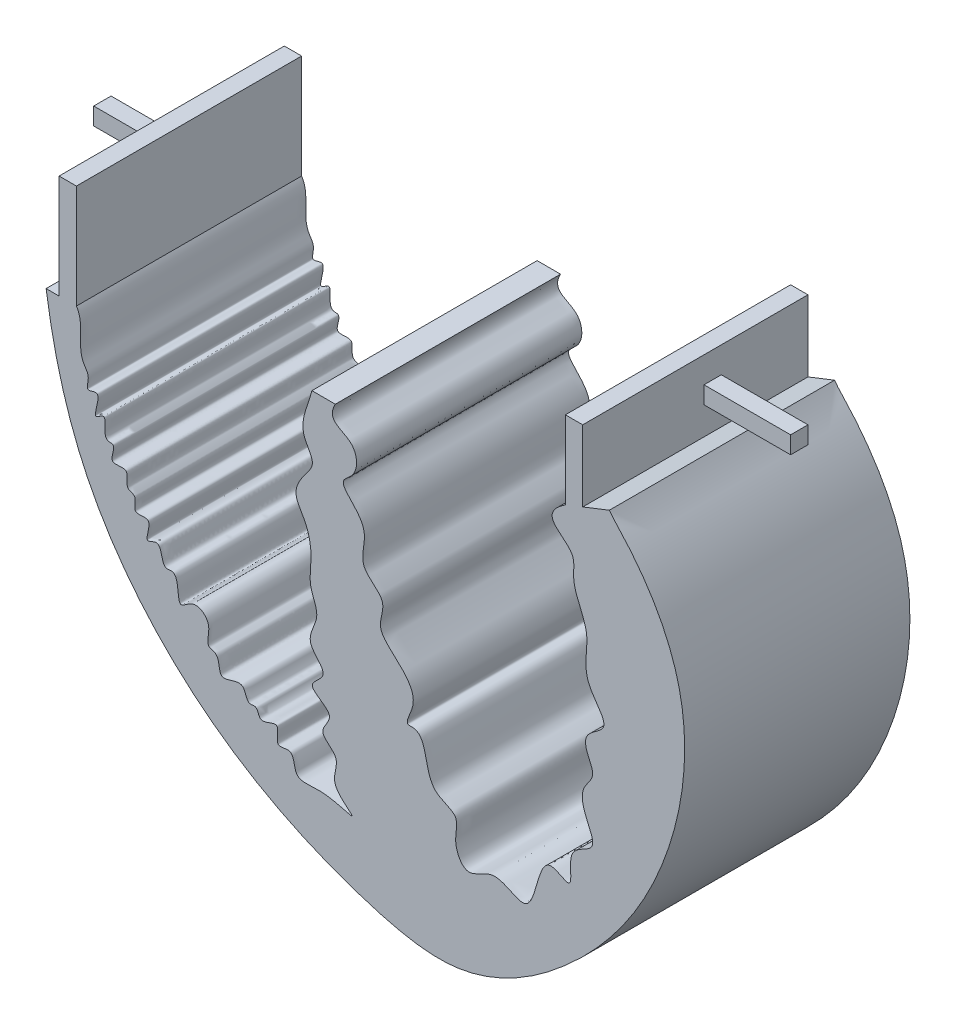
ISO-10303-21;
HEADER;
FILE_DESCRIPTION(('STEP AP214'),'2;1');
FILE_NAME('part.step','',(''),(''),'','','');
FILE_SCHEMA(('AUTOMOTIVE_DESIGN { 1 0 10303 214 1 1 1 1 }'));
ENDSEC;
DATA;
#1=APPLICATION_CONTEXT('core data for automotive mechanical design processes');
#2=APPLICATION_PROTOCOL_DEFINITION('international standard','automotive_design',2000,#1);
#3=PRODUCT_CONTEXT('',#1,'mechanical');
#4=PRODUCT('Part','Part','',(#3));
#5=PRODUCT_RELATED_PRODUCT_CATEGORY('part','',(#4));
#6=PRODUCT_DEFINITION_FORMATION('','',#4);
#7=PRODUCT_DEFINITION_CONTEXT('part definition',#1,'design');
#8=PRODUCT_DEFINITION('design','',#6,#7);
#9=PRODUCT_DEFINITION_SHAPE('','',#8);
#10=(LENGTH_UNIT() NAMED_UNIT(*) SI_UNIT(.MILLI.,.METRE.));
#11=(NAMED_UNIT(*) PLANE_ANGLE_UNIT() SI_UNIT($,.RADIAN.));
#12=(NAMED_UNIT(*) SI_UNIT($,.STERADIAN.) SOLID_ANGLE_UNIT());
#13=UNCERTAINTY_MEASURE_WITH_UNIT(LENGTH_MEASURE(1.E-05),#10,'distance_accuracy_value','');
#14=(GEOMETRIC_REPRESENTATION_CONTEXT(3) GLOBAL_UNCERTAINTY_ASSIGNED_CONTEXT((#13)) GLOBAL_UNIT_ASSIGNED_CONTEXT((#10,
#11,#12)) REPRESENTATION_CONTEXT('',''));
#15=CARTESIAN_POINT('',(0.,0.,0.));
#16=DIRECTION('',(0.,0.,1.));
#17=DIRECTION('',(1.,0.,0.));
#18=AXIS2_PLACEMENT_3D('',#15,#16,#17);
#19=CARTESIAN_POINT('',(234.782900174087,315.001155653343,33.02));
#20=DIRECTION('',(-1.,0.,0.));
#21=DIRECTION('',(0.,-1.,0.));
#22=AXIS2_PLACEMENT_3D('',#19,#20,#21);
#23=PLANE('',#22);
#24=DIRECTION('',(0.,1.,0.));
#25=VECTOR('',#24,1.);
#26=CARTESIAN_POINT('',(234.782900174087,315.001155653343,0.));
#27=LINE('',#26,#25);
#28=CARTESIAN_POINT('',(234.782900174087,315.001155653343,0.));
#29=VERTEX_POINT('',#28);
#30=CARTESIAN_POINT('',(234.782900174087,325.43096637939,0.));
#31=VERTEX_POINT('',#30);
#32=EDGE_CURVE('E648',#29,#31,#27,.T.);
#33=ORIENTED_EDGE('',*,*,#32,.T.);
#34=DIRECTION('',(0.,0.,-1.));
#35=VECTOR('',#34,1.);
#36=CARTESIAN_POINT('',(234.782900174087,325.43096637939,33.02));
#37=LINE('',#36,#35);
#38=CARTESIAN_POINT('',(234.782900174087,325.43096637939,33.02));
#39=VERTEX_POINT('',#38);
#40=EDGE_CURVE('E655',#39,#31,#37,.T.);
#41=ORIENTED_EDGE('',*,*,#40,.F.);
#42=DIRECTION('',(0.,1.,0.));
#43=VECTOR('',#42,1.);
#44=CARTESIAN_POINT('',(234.782900174087,315.001155653343,33.02));
#45=LINE('',#44,#43);
#46=CARTESIAN_POINT('',(234.782900174087,315.001155653343,33.02));
#47=VERTEX_POINT('',#46);
#48=EDGE_CURVE('E653',#47,#39,#45,.T.);
#49=ORIENTED_EDGE('',*,*,#48,.F.);
#50=DIRECTION('',(0.,0.,-1.));
#51=VECTOR('',#50,1.);
#52=CARTESIAN_POINT('',(234.782900174087,315.001155653343,33.02));
#53=LINE('',#52,#51);
#54=EDGE_CURVE('E641',#47,#29,#53,.T.);
#55=ORIENTED_EDGE('',*,*,#54,.T.);
#56=EDGE_LOOP('',(#33,#41,#49,#55));
#57=FACE_BOUND('',#56,.T.);
#58=DIRECTION('',(0.,-1.,0.));
#59=VECTOR('',#58,1.);
#60=CARTESIAN_POINT('',(234.782900174087,321.620966379391,15.24));
#61=LINE('',#60,#59);
#62=CARTESIAN_POINT('',(234.782900174087,321.620966379391,15.24));
#63=VERTEX_POINT('',#62);
#64=CARTESIAN_POINT('',(234.782900174087,319.080966379391,15.24));
#65=VERTEX_POINT('',#64);
#66=EDGE_CURVE('E209',#63,#65,#61,.T.);
#67=ORIENTED_EDGE('',*,*,#66,.F.);
#68=DIRECTION('',(0.,0.,1.));
#69=VECTOR('',#68,1.);
#70=CARTESIAN_POINT('',(234.782900174087,321.620966379391,15.24));
#71=LINE('',#70,#69);
#72=CARTESIAN_POINT('',(234.782900174087,321.620966379391,12.7));
#73=VERTEX_POINT('',#72);
#74=EDGE_CURVE('E206',#73,#63,#71,.T.);
#75=ORIENTED_EDGE('',*,*,#74,.F.);
#76=DIRECTION('',(0.,1.,0.));
#77=VECTOR('',#76,1.);
#78=CARTESIAN_POINT('',(234.782900174087,321.620966379391,12.7));
#79=LINE('',#78,#77);
#80=CARTESIAN_POINT('',(234.782900174087,319.080966379391,12.7));
#81=VERTEX_POINT('',#80);
#82=EDGE_CURVE('E70',#81,#73,#79,.T.);
#83=ORIENTED_EDGE('',*,*,#82,.F.);
#84=DIRECTION('',(0.,0.,-1.));
#85=VECTOR('',#84,1.);
#86=CARTESIAN_POINT('',(234.782900174087,319.080966379391,15.24));
#87=LINE('',#86,#85);
#88=EDGE_CURVE('E65',#65,#81,#87,.T.);
#89=ORIENTED_EDGE('',*,*,#88,.F.);
#90=EDGE_LOOP('',(#67,#75,#83,#89));
#91=FACE_BOUND('',#90,.T.);
#92=ADVANCED_FACE('F49',(#57,#91),#23,.F.);
#93=CARTESIAN_POINT('',(158.008998456197,303.390768234558,33.02));
#94=DIRECTION('',(1.,0.,0.));
#95=DIRECTION('',(0.,0.,-1.));
#96=AXIS2_PLACEMENT_3D('',#93,#94,#95);
#97=PLANE('',#96);
#98=DIRECTION('',(0.,-1.,0.));
#99=VECTOR('',#98,1.);
#100=CARTESIAN_POINT('',(158.008998456197,303.390768234558,0.));
#101=LINE('',#100,#99);
#102=CARTESIAN_POINT('',(158.008998456197,318.630768234558,0.));
#103=VERTEX_POINT('',#102);
#104=CARTESIAN_POINT('',(158.008998456197,303.390768234558,0.));
#105=VERTEX_POINT('',#104);
#106=EDGE_CURVE('E262',#103,#105,#101,.T.);
#107=ORIENTED_EDGE('',*,*,#106,.T.);
#108=DIRECTION('',(0.,0.,-1.));
#109=VECTOR('',#108,1.);
#110=CARTESIAN_POINT('',(158.008998456197,303.390768234558,33.02));
#111=LINE('',#110,#109);
#112=CARTESIAN_POINT('',(158.008998456197,303.390768234558,33.02));
#113=VERTEX_POINT('',#112);
#114=EDGE_CURVE('E11',#113,#105,#111,.T.);
#115=ORIENTED_EDGE('',*,*,#114,.F.);
#116=DIRECTION('',(0.,-1.,0.));
#117=VECTOR('',#116,1.);
#118=CARTESIAN_POINT('',(158.008998456197,303.390768234558,33.02));
#119=LINE('',#118,#117);
#120=CARTESIAN_POINT('',(158.008998456197,318.630768234558,33.02));
#121=VERTEX_POINT('',#120);
#122=EDGE_CURVE('E263',#121,#113,#119,.T.);
#123=ORIENTED_EDGE('',*,*,#122,.F.);
#124=DIRECTION('',(0.,0.,-1.));
#125=VECTOR('',#124,1.);
#126=CARTESIAN_POINT('',(158.008998456197,318.630768234558,33.02));
#127=LINE('',#126,#125);
#128=EDGE_CURVE('E694',#121,#103,#127,.T.);
#129=ORIENTED_EDGE('',*,*,#128,.T.);
#130=EDGE_LOOP('',(#107,#115,#123,#129));
#131=FACE_BOUND('',#130,.T.);
#132=DIRECTION('',(0.,-1.,0.));
#133=VECTOR('',#132,1.);
#134=CARTESIAN_POINT('',(158.008998456197,312.280768234558,12.7));
#135=LINE('',#134,#133);
#136=CARTESIAN_POINT('',(158.008998456197,312.280768234558,12.7));
#137=VERTEX_POINT('',#136);
#138=CARTESIAN_POINT('',(158.008998456197,309.740768234558,12.7));
#139=VERTEX_POINT('',#138);
#140=EDGE_CURVE('E211',#137,#139,#135,.T.);
#141=ORIENTED_EDGE('',*,*,#140,.F.);
#142=DIRECTION('',(0.,0.,-1.));
#143=VECTOR('',#142,1.);
#144=CARTESIAN_POINT('',(158.008998456197,312.280768234558,12.7));
#145=LINE('',#144,#143);
#146=CARTESIAN_POINT('',(158.008998456197,312.280768234558,15.24));
#147=VERTEX_POINT('',#146);
#148=EDGE_CURVE('E227',#147,#137,#145,.T.);
#149=ORIENTED_EDGE('',*,*,#148,.F.);
#150=DIRECTION('',(0.,1.,0.));
#151=VECTOR('',#150,1.);
#152=CARTESIAN_POINT('',(158.008998456197,312.280768234558,15.24));
#153=LINE('',#152,#151);
#154=CARTESIAN_POINT('',(158.008998456197,309.740768234558,15.24));
#155=VERTEX_POINT('',#154);
#156=EDGE_CURVE('E240',#155,#147,#153,.T.);
#157=ORIENTED_EDGE('',*,*,#156,.F.);
#158=DIRECTION('',(0.,0.,1.));
#159=VECTOR('',#158,1.);
#160=CARTESIAN_POINT('',(158.008998456197,309.740768234558,12.7));
#161=LINE('',#160,#159);
#162=EDGE_CURVE('E216',#139,#155,#161,.T.);
#163=ORIENTED_EDGE('',*,*,#162,.F.);
#164=EDGE_LOOP('',(#141,#149,#157,#163));
#165=FACE_BOUND('',#164,.T.);
#166=ADVANCED_FACE('F51',(#131,#165),#97,.F.);
#167=CARTESIAN_POINT('',(156.106031245174,303.390768234558,33.02));
#168=DIRECTION('',(0.,-1.,0.));
#169=DIRECTION('',(0.,0.,-1.));
#170=AXIS2_PLACEMENT_3D('',#167,#168,#169);
#171=PLANE('',#170);
#172=DIRECTION('',(-1.,0.,0.));
#173=VECTOR('',#172,1.);
#174=CARTESIAN_POINT('',(156.106031245174,303.390768234558,0.));
#175=LINE('',#174,#173);
#176=CARTESIAN_POINT('',(156.106031245174,303.390768234558,0.));
#177=VERTEX_POINT('',#176);
#178=EDGE_CURVE('E730',#105,#177,#175,.T.);
#179=ORIENTED_EDGE('',*,*,#178,.T.);
#180=DIRECTION('',(0.,0.,-1.));
#181=VECTOR('',#180,1.);
#182=CARTESIAN_POINT('',(156.106031245174,303.390768234558,33.02));
#183=LINE('',#182,#181);
#184=CARTESIAN_POINT('',(156.106031245174,303.390768234558,33.02));
#185=VERTEX_POINT('',#184);
#186=EDGE_CURVE('E58',#185,#177,#183,.T.);
#187=ORIENTED_EDGE('',*,*,#186,.F.);
#188=DIRECTION('',(-1.,0.,0.));
#189=VECTOR('',#188,1.);
#190=CARTESIAN_POINT('',(156.106031245174,303.390768234558,33.02));
#191=LINE('',#190,#189);
#192=EDGE_CURVE('E267',#113,#185,#191,.T.);
#193=ORIENTED_EDGE('',*,*,#192,.F.);
#194=ORIENTED_EDGE('',*,*,#114,.T.);
#195=EDGE_LOOP('',(#179,#187,#193,#194));
#196=FACE_BOUND('',#195,.T.);
#197=ADVANCED_FACE('F287',(#196),#171,.F.);
#198=CARTESIAN_POINT('',(156.106031245174,303.390768234558,33.02));
#199=CARTESIAN_POINT('',(157.104104191123,296.55036160736,33.02));
#200=CARTESIAN_POINT('',(161.019969177918,280.596962499826,33.02));
#201=CARTESIAN_POINT('',(177.796499221937,260.091211672774,33.02));
#202=CARTESIAN_POINT('',(198.125508088676,249.89125202118,33.02));
#203=CARTESIAN_POINT('',(218.238222953923,245.296073749802,33.02));
#204=CARTESIAN_POINT('',(234.550765535229,255.901833712278,33.02));
#205=CARTESIAN_POINT('',(247.937650512557,274.044596413162,33.02));
#206=CARTESIAN_POINT('',(252.142183864828,297.70290722612,33.02));
#207=CARTESIAN_POINT('',(243.608906344327,311.34256770418,33.02));
#208=CARTESIAN_POINT('',(239.060814083883,315.97952400588,33.02));
#209=CARTESIAN_POINT('',(238.685163096089,316.537770424497,33.02));
#210=B_SPLINE_CURVE_WITH_KNOTS('',3,(#198,#199,#200,#201,#202,#203,#204,#205,#206,#207,#208,
#209),.UNSPECIFIED.,.F.,.F.,(4,1,1,1,1,1,1,1,1,4),(0.120046571813157,0.18483385758498,
0.273021776294878,0.359649236978444,0.397816633725217,0.461195161311988,0.526426676141084,
0.612455038105468,0.666069006609974,0.672633998429617),.UNSPECIFIED.);
#211=DIRECTION('',(0.,0.,-1.));
#212=VECTOR('',#211,1.);
#213=SURFACE_OF_LINEAR_EXTRUSION('',#210,#212);
#214=CARTESIAN_POINT('',(156.106031245174,303.390768234558,0.));
#215=CARTESIAN_POINT('',(157.104104191123,296.55036160736,0.));
#216=CARTESIAN_POINT('',(161.019969177918,280.596962499826,0.));
#217=CARTESIAN_POINT('',(177.796499221937,260.091211672774,0.));
#218=CARTESIAN_POINT('',(198.125508088676,249.89125202118,0.));
#219=CARTESIAN_POINT('',(218.238222953923,245.296073749802,0.));
#220=CARTESIAN_POINT('',(234.550765535229,255.901833712278,0.));
#221=CARTESIAN_POINT('',(247.937650512557,274.044596413162,0.));
#222=CARTESIAN_POINT('',(252.142183864828,297.70290722612,0.));
#223=CARTESIAN_POINT('',(243.608906344327,311.34256770418,0.));
#224=CARTESIAN_POINT('',(239.060814083883,315.97952400588,0.));
#225=CARTESIAN_POINT('',(238.685163096089,316.537770424497,0.));
#226=B_SPLINE_CURVE_WITH_KNOTS('',3,(#214,#215,#216,#217,#218,#219,#220,#221,#222,#223,#224,
#225),.UNSPECIFIED.,.F.,.F.,(4,1,1,1,1,1,1,1,1,4),(0.120046571813157,0.18483385758498,
0.273021776294878,0.359649236978444,0.397816633725217,0.461195161311988,0.526426676141084,
0.612455038105468,0.666069006609974,0.672633998429617),.UNSPECIFIED.);
#227=CARTESIAN_POINT('',(238.685163096089,316.537770424497,0.));
#228=VERTEX_POINT('',#227);
#229=EDGE_CURVE('E649',#177,#228,#226,.T.);
#230=ORIENTED_EDGE('',*,*,#229,.T.);
#231=DIRECTION('',(0.,0.,-1.));
#232=VECTOR('',#231,1.);
#233=CARTESIAN_POINT('',(238.685163096089,316.537770424497,33.02));
#234=LINE('',#233,#232);
#235=CARTESIAN_POINT('',(238.685163096089,316.537770424497,33.02));
#236=VERTEX_POINT('',#235);
#237=EDGE_CURVE('E644',#236,#228,#234,.T.);
#238=ORIENTED_EDGE('',*,*,#237,.F.);
#239=EDGE_CURVE('E271',#185,#236,#210,.T.);
#240=ORIENTED_EDGE('',*,*,#239,.F.);
#241=ORIENTED_EDGE('',*,*,#186,.T.);
#242=EDGE_LOOP('',(#230,#238,#240,#241));
#243=FACE_BOUND('',#242,.T.);
#244=ADVANCED_FACE('F283',(#243),#213,.F.);
#245=CARTESIAN_POINT('',(234.782900174087,315.001155653343,33.02));
#246=DIRECTION('',(0.366392347011726,-0.930460449482534,0.));
#247=DIRECTION('',(0.930460449482534,0.366392347011726,0.));
#248=AXIS2_PLACEMENT_3D('',#245,#246,#247);
#249=PLANE('',#248);
#250=DIRECTION('',(-0.930460449482534,-0.366392347011726,0.));
#251=VECTOR('',#250,1.);
#252=CARTESIAN_POINT('',(234.782900174087,315.001155653343,0.));
#253=LINE('',#252,#251);
#254=EDGE_CURVE('E638',#228,#29,#253,.T.);
#255=ORIENTED_EDGE('',*,*,#254,.T.);
#256=ORIENTED_EDGE('',*,*,#54,.F.);
#257=DIRECTION('',(-0.930460449482534,-0.366392347011726,0.));
#258=VECTOR('',#257,1.);
#259=CARTESIAN_POINT('',(234.782900174087,315.001155653343,33.02));
#260=LINE('',#259,#258);
#261=EDGE_CURVE('E277',#236,#47,#260,.T.);
#262=ORIENTED_EDGE('',*,*,#261,.F.);
#263=ORIENTED_EDGE('',*,*,#237,.T.);
#264=EDGE_LOOP('',(#255,#256,#262,#263));
#265=FACE_BOUND('',#264,.T.);
#266=ADVANCED_FACE('F286',(#265),#249,.F.);
#267=CARTESIAN_POINT('',(232.242900174087,325.43096637939,33.02));
#268=DIRECTION('',(0.,-1.,0.));
#269=DIRECTION('',(0.,0.,-1.));
#270=AXIS2_PLACEMENT_3D('',#267,#268,#269);
#271=PLANE('',#270);
#272=DIRECTION('',(-1.,0.,0.));
#273=VECTOR('',#272,1.);
#274=CARTESIAN_POINT('',(232.242900174087,325.43096637939,0.));
#275=LINE('',#274,#273);
#276=CARTESIAN_POINT('',(232.242900174087,325.43096637939,0.));
#277=VERTEX_POINT('',#276);
#278=EDGE_CURVE('E660',#31,#277,#275,.T.);
#279=ORIENTED_EDGE('',*,*,#278,.T.);
#280=DIRECTION('',(0.,0.,-1.));
#281=VECTOR('',#280,1.);
#282=CARTESIAN_POINT('',(232.242900174087,325.43096637939,33.02));
#283=LINE('',#282,#281);
#284=CARTESIAN_POINT('',(232.242900174087,325.43096637939,33.02));
#285=VERTEX_POINT('',#284);
#286=EDGE_CURVE('E719',#285,#277,#283,.T.);
#287=ORIENTED_EDGE('',*,*,#286,.F.);
#288=DIRECTION('',(-1.,0.,0.));
#289=VECTOR('',#288,1.);
#290=CARTESIAN_POINT('',(232.242900174087,325.43096637939,33.02));
#291=LINE('',#290,#289);
#292=EDGE_CURVE('E766',#39,#285,#291,.T.);
#293=ORIENTED_EDGE('',*,*,#292,.F.);
#294=ORIENTED_EDGE('',*,*,#40,.T.);
#295=EDGE_LOOP('',(#279,#287,#293,#294));
#296=FACE_BOUND('',#295,.T.);
#297=ADVANCED_FACE('F301',(#296),#271,.F.);
#298=CARTESIAN_POINT('',(232.242900174087,314.00096637939,33.02));
#299=DIRECTION('',(1.,0.,0.));
#300=DIRECTION('',(0.,1.,0.));
#301=AXIS2_PLACEMENT_3D('',#298,#299,#300);
#302=PLANE('',#301);
#303=DIRECTION('',(0.,-1.,0.));
#304=VECTOR('',#303,1.);
#305=CARTESIAN_POINT('',(232.242900174087,314.00096637939,0.));
#306=LINE('',#305,#304);
#307=CARTESIAN_POINT('',(232.242900174087,314.00096637939,0.));
#308=VERTEX_POINT('',#307);
#309=EDGE_CURVE('E664',#277,#308,#306,.T.);
#310=ORIENTED_EDGE('',*,*,#309,.T.);
#311=DIRECTION('',(0.,0.,-1.));
#312=VECTOR('',#311,1.);
#313=CARTESIAN_POINT('',(232.242900174087,314.00096637939,33.02));
#314=LINE('',#313,#312);
#315=CARTESIAN_POINT('',(232.242900174087,314.00096637939,33.02));
#316=VERTEX_POINT('',#315);
#317=EDGE_CURVE('E715',#316,#308,#314,.T.);
#318=ORIENTED_EDGE('',*,*,#317,.F.);
#319=DIRECTION('',(0.,-1.,0.));
#320=VECTOR('',#319,1.);
#321=CARTESIAN_POINT('',(232.242900174087,314.00096637939,33.02));
#322=LINE('',#321,#320);
#323=EDGE_CURVE('E324',#285,#316,#322,.T.);
#324=ORIENTED_EDGE('',*,*,#323,.F.);
#325=ORIENTED_EDGE('',*,*,#286,.T.);
#326=EDGE_LOOP('',(#310,#318,#324,#325));
#327=FACE_BOUND('',#326,.T.);
#328=ADVANCED_FACE('F304',(#327),#302,.F.);
#329=CARTESIAN_POINT('',(232.242900174087,314.00096637939,33.02));
#330=CARTESIAN_POINT('',(227.671804131511,310.911582782243,33.02));
#331=CARTESIAN_POINT('',(234.136214335651,309.889104916848,33.02));
#332=CARTESIAN_POINT('',(232.946305113678,303.982238356579,33.02));
#333=CARTESIAN_POINT('',(236.523101877084,299.438760497098,33.02));
#334=CARTESIAN_POINT('',(234.068850409461,293.382823198742,33.02));
#335=CARTESIAN_POINT('',(239.640418941063,288.496705906343,33.02));
#336=CARTESIAN_POINT('',(235.027987848468,286.833031251468,33.02));
#337=CARTESIAN_POINT('',(235.252441084964,283.954509520718,33.02));
#338=CARTESIAN_POINT('',(236.960962033727,281.71833217354,33.02));
#339=CARTESIAN_POINT('',(234.246376724133,279.169245617661,33.02));
#340=CARTESIAN_POINT('',(235.0501118623,275.97408668369,33.02));
#341=CARTESIAN_POINT('',(237.292331837876,271.926073935689,33.02));
#342=CARTESIAN_POINT('',(231.852678162955,271.180365969917,33.02));
#343=CARTESIAN_POINT('',(234.002977415386,264.668151286691,33.02));
#344=CARTESIAN_POINT('',(229.667333922357,268.11217542901,33.02));
#345=CARTESIAN_POINT('',(227.94994718765,264.066759542461,33.02));
#346=CARTESIAN_POINT('',(226.975453852495,258.494830155818,33.02));
#347=CARTESIAN_POINT('',(221.808619745907,263.162915753511,33.02));
#348=CARTESIAN_POINT('',(217.868120503794,258.950344702888,33.02));
#349=CARTESIAN_POINT('',(215.577318933515,263.123148610677,33.02));
#350=CARTESIAN_POINT('',(217.05085008753,266.877594649691,33.02));
#351=CARTESIAN_POINT('',(210.893647390675,267.774037068134,33.02));
#352=CARTESIAN_POINT('',(212.314402753719,274.830072870232,33.02));
#353=CARTESIAN_POINT('',(208.589492444135,274.449085400766,33.02));
#354=CARTESIAN_POINT('',(210.140849663169,277.093565791031,33.02));
#355=CARTESIAN_POINT('',(209.822955085306,279.849652934108,33.02));
#356=CARTESIAN_POINT('',(207.259496886262,282.187310117453,33.02));
#357=CARTESIAN_POINT('',(204.403608675191,284.84057962127,33.02));
#358=CARTESIAN_POINT('',(206.520878740594,288.811924176498,33.02));
#359=CARTESIAN_POINT('',(201.505991196306,290.940771209474,33.02));
#360=CARTESIAN_POINT('',(203.485875999439,295.641372698432,33.02));
#361=CARTESIAN_POINT('',(201.463265959784,298.263143368982,33.02));
#362=CARTESIAN_POINT('',(198.939635821378,300.698791609971,33.02));
#363=CARTESIAN_POINT('',(201.90704669428,302.344488404036,33.02));
#364=CARTESIAN_POINT('',(201.745388274955,307.362657876807,33.02));
#365=CARTESIAN_POINT('',(197.023380523411,307.185551244616,33.02));
#366=CARTESIAN_POINT('',(198.510595776635,309.912787822119,33.02));
#367=B_SPLINE_CURVE_WITH_KNOTS('',3,(#329,#330,#331,#332,#333,#334,#335,#336,#337,#338,#339,
#340,#341,#342,#343,#344,#345,#346,#347,#348,#349,#350,#351,#352,#353,#354,#355,#356,#357,#358,
#359,#360,#361,#362,#363,#364,#365,#366),.UNSPECIFIED.,.F.,.F.,(4,1,1,1,1,1,1,1,1,1,1,1,1,1,1,1,
1,1,1,1,1,1,1,1,1,1,1,1,1,1,1,1,1,1,1,4),(0.,0.0568630812964293,0.0761569701214686,
0.125681481869213,0.174977939206979,0.212032065009173,0.238290939002593,0.251121241436887,
0.273458381954533,0.292714565368975,0.321608124647044,0.346439130694548,0.374923318482737,
0.406013849225756,0.426833104557949,0.448910328773812,0.486721666917366,0.522491181783571,
0.553871031326096,0.578321156591031,0.603352745361028,0.628969066612945,0.685503964445555,
0.688401036235807,0.705266665736635,0.724423159981932,0.758457963336956,0.780438988231214,
0.805599044084671,0.837401513577967,0.869708798439071,0.897417821447186,0.915700964250314,
0.930087156957054,0.959522893512256,1.),.UNSPECIFIED.);
#368=DIRECTION('',(0.,0.,-1.));
#369=VECTOR('',#368,1.);
#370=SURFACE_OF_LINEAR_EXTRUSION('',#367,#369);
#371=CARTESIAN_POINT('',(232.242900174087,314.00096637939,0.));
#372=CARTESIAN_POINT('',(227.671804131511,310.911582782243,0.));
#373=CARTESIAN_POINT('',(234.136214335651,309.889104916848,0.));
#374=CARTESIAN_POINT('',(232.946305113678,303.982238356579,0.));
#375=CARTESIAN_POINT('',(236.523101877084,299.438760497098,0.));
#376=CARTESIAN_POINT('',(234.068850409461,293.382823198742,0.));
#377=CARTESIAN_POINT('',(239.640418941063,288.496705906343,0.));
#378=CARTESIAN_POINT('',(235.027987848468,286.833031251468,0.));
#379=CARTESIAN_POINT('',(235.252441084964,283.954509520718,0.));
#380=CARTESIAN_POINT('',(236.960962033727,281.71833217354,0.));
#381=CARTESIAN_POINT('',(234.246376724133,279.169245617661,0.));
#382=CARTESIAN_POINT('',(235.0501118623,275.97408668369,0.));
#383=CARTESIAN_POINT('',(237.292331837876,271.926073935689,0.));
#384=CARTESIAN_POINT('',(231.852678162955,271.180365969917,0.));
#385=CARTESIAN_POINT('',(234.002977415386,264.668151286691,0.));
#386=CARTESIAN_POINT('',(229.667333922357,268.11217542901,0.));
#387=CARTESIAN_POINT('',(227.94994718765,264.066759542461,0.));
#388=CARTESIAN_POINT('',(226.975453852495,258.494830155818,0.));
#389=CARTESIAN_POINT('',(221.808619745907,263.162915753511,0.));
#390=CARTESIAN_POINT('',(217.868120503794,258.950344702888,0.));
#391=CARTESIAN_POINT('',(215.577318933515,263.123148610677,0.));
#392=CARTESIAN_POINT('',(217.05085008753,266.877594649691,0.));
#393=CARTESIAN_POINT('',(210.893647390675,267.774037068134,0.));
#394=CARTESIAN_POINT('',(212.314402753719,274.830072870232,0.));
#395=CARTESIAN_POINT('',(208.589492444135,274.449085400766,0.));
#396=CARTESIAN_POINT('',(210.140849663169,277.093565791031,0.));
#397=CARTESIAN_POINT('',(209.822955085306,279.849652934108,0.));
#398=CARTESIAN_POINT('',(207.259496886262,282.187310117453,0.));
#399=CARTESIAN_POINT('',(204.403608675191,284.84057962127,0.));
#400=CARTESIAN_POINT('',(206.520878740594,288.811924176498,0.));
#401=CARTESIAN_POINT('',(201.505991196306,290.940771209474,0.));
#402=CARTESIAN_POINT('',(203.485875999439,295.641372698432,0.));
#403=CARTESIAN_POINT('',(201.463265959784,298.263143368982,0.));
#404=CARTESIAN_POINT('',(198.939635821378,300.698791609971,0.));
#405=CARTESIAN_POINT('',(201.90704669428,302.344488404036,0.));
#406=CARTESIAN_POINT('',(201.745388274955,307.362657876807,0.));
#407=CARTESIAN_POINT('',(197.023380523411,307.185551244616,0.));
#408=CARTESIAN_POINT('',(198.510595776635,309.912787822119,0.));
#409=B_SPLINE_CURVE_WITH_KNOTS('',3,(#371,#372,#373,#374,#375,#376,#377,#378,#379,#380,#381,
#382,#383,#384,#385,#386,#387,#388,#389,#390,#391,#392,#393,#394,#395,#396,#397,#398,#399,#400,
#401,#402,#403,#404,#405,#406,#407,#408),.UNSPECIFIED.,.F.,.F.,(4,1,1,1,1,1,1,1,1,1,1,1,1,1,1,1,
1,1,1,1,1,1,1,1,1,1,1,1,1,1,1,1,1,1,1,4),(0.,0.0568630812964293,0.0761569701214686,
0.125681481869213,0.174977939206979,0.212032065009173,0.238290939002593,0.251121241436887,
0.273458381954533,0.292714565368975,0.321608124647044,0.346439130694548,0.374923318482737,
0.406013849225756,0.426833104557949,0.448910328773812,0.486721666917366,0.522491181783571,
0.553871031326096,0.578321156591031,0.603352745361028,0.628969066612945,0.685503964445555,
0.688401036235807,0.705266665736635,0.724423159981932,0.758457963336956,0.780438988231214,
0.805599044084671,0.837401513577967,0.869708798439071,0.897417821447186,0.915700964250314,
0.930087156957054,0.959522893512256,1.),.UNSPECIFIED.);
#410=CARTESIAN_POINT('',(198.510595776635,309.912787822119,0.));
#411=VERTEX_POINT('',#410);
#412=EDGE_CURVE('E670',#308,#411,#409,.T.);
#413=ORIENTED_EDGE('',*,*,#412,.T.);
#414=DIRECTION('',(0.,0.,-1.));
#415=VECTOR('',#414,1.);
#416=CARTESIAN_POINT('',(198.510595776635,309.912787822119,33.02));
#417=LINE('',#416,#415);
#418=CARTESIAN_POINT('',(198.510595776635,309.912787822119,33.02));
#419=VERTEX_POINT('',#418);
#420=EDGE_CURVE('E711',#419,#411,#417,.T.);
#421=ORIENTED_EDGE('',*,*,#420,.F.);
#422=EDGE_CURVE('E316',#316,#419,#367,.T.);
#423=ORIENTED_EDGE('',*,*,#422,.F.);
#424=ORIENTED_EDGE('',*,*,#317,.T.);
#425=EDGE_LOOP('',(#413,#421,#423,#424));
#426=FACE_BOUND('',#425,.T.);
#427=ADVANCED_FACE('F308',(#426),#370,.F.);
#428=CARTESIAN_POINT('',(195.074450087815,309.912787822119,33.02));
#429=DIRECTION('',(0.,-1.,0.));
#430=DIRECTION('',(0.,0.,-1.));
#431=AXIS2_PLACEMENT_3D('',#428,#429,#430);
#432=PLANE('',#431);
#433=DIRECTION('',(-1.,0.,0.));
#434=VECTOR('',#433,1.);
#435=CARTESIAN_POINT('',(195.074450087815,309.912787822119,0.));
#436=LINE('',#435,#434);
#437=CARTESIAN_POINT('',(195.074450087815,309.912787822119,0.));
#438=VERTEX_POINT('',#437);
#439=EDGE_CURVE('E675',#411,#438,#436,.T.);
#440=ORIENTED_EDGE('',*,*,#439,.T.);
#441=DIRECTION('',(0.,0.,-1.));
#442=VECTOR('',#441,1.);
#443=CARTESIAN_POINT('',(195.074450087815,309.912787822119,33.02));
#444=LINE('',#443,#442);
#445=CARTESIAN_POINT('',(195.074450087815,309.912787822119,33.02));
#446=VERTEX_POINT('',#445);
#447=EDGE_CURVE('E707',#446,#438,#444,.T.);
#448=ORIENTED_EDGE('',*,*,#447,.F.);
#449=DIRECTION('',(-1.,0.,0.));
#450=VECTOR('',#449,1.);
#451=CARTESIAN_POINT('',(195.074450087815,309.912787822119,33.02));
#452=LINE('',#451,#450);
#453=EDGE_CURVE('E323',#419,#446,#452,.T.);
#454=ORIENTED_EDGE('',*,*,#453,.F.);
#455=ORIENTED_EDGE('',*,*,#420,.T.);
#456=EDGE_LOOP('',(#440,#448,#454,#455));
#457=FACE_BOUND('',#456,.T.);
#458=ADVANCED_FACE('F313',(#457),#432,.F.);
#459=CARTESIAN_POINT('',(195.074450087815,309.912787822119,33.02));
#460=CARTESIAN_POINT('',(194.642747282223,307.906103466199,33.02));
#461=CARTESIAN_POINT('',(192.543315860785,304.49355623238,33.02));
#462=CARTESIAN_POINT('',(195.831067961202,300.855456636174,33.02));
#463=CARTESIAN_POINT('',(193.698148382803,298.433730213093,33.02));
#464=CARTESIAN_POINT('',(192.086983347933,295.638759690242,33.02));
#465=CARTESIAN_POINT('',(194.640861310372,292.398623495681,33.02));
#466=CARTESIAN_POINT('',(195.155469766405,288.693248216536,33.02));
#467=CARTESIAN_POINT('',(194.506833195403,284.844918277452,33.02));
#468=CARTESIAN_POINT('',(196.694345124454,281.471938069383,33.02));
#469=CARTESIAN_POINT('',(193.413130963577,277.721581829965,33.02));
#470=CARTESIAN_POINT('',(198.199721975422,274.826809253713,33.02));
#471=CARTESIAN_POINT('',(193.387434176877,272.181884508653,33.02));
#472=CARTESIAN_POINT('',(199.25986979412,270.408009393388,33.02));
#473=CARTESIAN_POINT('',(195.45173011253,267.162293282001,33.02));
#474=CARTESIAN_POINT('',(199.787020442157,265.257412985397,33.02));
#475=CARTESIAN_POINT('',(197.119021393041,261.50715448549,33.02));
#476=CARTESIAN_POINT('',(203.091149437713,257.786426719686,33.02));
#477=CARTESIAN_POINT('',(196.49616159554,260.400513393585,33.02));
#478=CARTESIAN_POINT('',(192.340760215468,258.853353991803,33.02));
#479=CARTESIAN_POINT('',(192.5012547679,263.176689778624,33.02));
#480=CARTESIAN_POINT('',(189.335066676203,261.728140720923,33.02));
#481=CARTESIAN_POINT('',(190.87649459529,266.155571450808,33.02));
#482=CARTESIAN_POINT('',(187.295300144883,263.459479363285,33.02));
#483=CARTESIAN_POINT('',(187.128838306155,265.900865217549,33.02));
#484=CARTESIAN_POINT('',(185.426454035026,265.276816451837,33.02));
#485=CARTESIAN_POINT('',(185.332167560546,268.688919921882,33.02));
#486=CARTESIAN_POINT('',(181.00697700817,265.57922386501,33.02));
#487=CARTESIAN_POINT('',(181.711627392179,269.544042864464,33.02));
#488=CARTESIAN_POINT('',(179.247342413354,269.770675032951,33.02));
#489=CARTESIAN_POINT('',(180.810316220506,272.789240188163,33.02));
#490=CARTESIAN_POINT('',(177.836072038408,274.969534175265,33.02));
#491=CARTESIAN_POINT('',(174.951405510017,271.618941916521,33.02));
#492=CARTESIAN_POINT('',(175.857943126464,277.232320912744,33.02));
#493=CARTESIAN_POINT('',(172.83677392161,276.285298176171,33.02));
#494=CARTESIAN_POINT('',(173.286445956241,280.170419596004,33.02));
#495=CARTESIAN_POINT('',(170.06153219407,277.968048359965,33.02));
#496=CARTESIAN_POINT('',(172.244386765131,282.341891870216,33.02));
#497=CARTESIAN_POINT('',(168.410554871308,280.905625742102,33.02));
#498=CARTESIAN_POINT('',(169.659247633204,283.679892548732,33.02));
#499=CARTESIAN_POINT('',(167.462604122336,283.885452185806,33.02));
#500=CARTESIAN_POINT('',(168.730425510637,286.920292115898,33.02));
#501=CARTESIAN_POINT('',(164.784154189468,285.500296622531,33.02));
#502=CARTESIAN_POINT('',(166.609541559748,288.720531870896,33.02));
#503=CARTESIAN_POINT('',(164.098899160974,288.334327444489,33.02));
#504=CARTESIAN_POINT('',(165.440628545756,292.455907007705,33.02));
#505=CARTESIAN_POINT('',(162.395669060328,289.672175782194,33.02));
#506=CARTESIAN_POINT('',(164.781447283427,294.770350027817,33.02));
#507=CARTESIAN_POINT('',(161.721660440031,293.107234673138,33.02));
#508=CARTESIAN_POINT('',(162.639094307759,295.416625970372,33.02));
#509=CARTESIAN_POINT('',(160.250956026507,297.852651646876,33.02));
#510=CARTESIAN_POINT('',(161.840810476351,301.443359262131,33.02));
#511=CARTESIAN_POINT('',(160.548998456197,303.390768234559,33.02));
#512=B_SPLINE_CURVE_WITH_KNOTS('',3,(#459,#460,#461,#462,#463,#464,#465,#466,#467,#468,#469,
#470,#471,#472,#473,#474,#475,#476,#477,#478,#479,#480,#481,#482,#483,#484,#485,#486,#487,#488,
#489,#490,#491,#492,#493,#494,#495,#496,#497,#498,#499,#500,#501,#502,#503,#504,#505,#506,#507,
#508,#509,#510,#511),.UNSPECIFIED.,.F.,.F.,(4,1,1,1,1,1,1,1,1,1,1,1,1,1,1,1,1,1,1,1,1,1,1,1,1,1,
1,1,1,1,1,1,1,1,1,1,1,1,1,1,1,1,1,1,1,1,1,1,1,1,4),(0.,0.050239288422547,0.0721907341356552,
0.0896821827419558,0.115155463273596,0.137674364587677,0.17377148563939,0.198465610933983,
0.223986161258001,0.254731036673837,0.281782676308602,0.300685026382,0.328566238609475,
0.34823673110342,0.370312391859667,0.397089861095965,0.424752203794696,0.457570387019624,
0.487876892337706,0.50563876063662,0.517691635508223,0.535111467051715,0.553295854343122,
0.563333581730356,0.56909800014721,0.584213568274624,0.607324774598385,0.627107354390114,
0.633169669025253,0.65366752924766,0.675178636443651,0.689658604640495,0.718274711859703,
0.724563168314452,0.746403675583878,0.756283739665123,0.775640444214254,0.789324705084854,
0.803762621392338,0.810806727017031,0.827014364443115,0.841885103830885,0.85779641801319,
0.863054774567647,0.884494267724925,0.892790359785174,0.915331388210105,0.924500809838541,
0.935992314525761,0.948080837294698,1.),.UNSPECIFIED.);
#513=DIRECTION('',(0.,0.,-1.));
#514=VECTOR('',#513,1.);
#515=SURFACE_OF_LINEAR_EXTRUSION('',#512,#514);
#516=CARTESIAN_POINT('',(195.074450087815,309.912787822119,0.));
#517=CARTESIAN_POINT('',(194.642747282223,307.906103466199,0.));
#518=CARTESIAN_POINT('',(192.543315860785,304.49355623238,0.));
#519=CARTESIAN_POINT('',(195.831067961202,300.855456636174,0.));
#520=CARTESIAN_POINT('',(193.698148382803,298.433730213093,0.));
#521=CARTESIAN_POINT('',(192.086983347933,295.638759690242,0.));
#522=CARTESIAN_POINT('',(194.640861310372,292.398623495681,0.));
#523=CARTESIAN_POINT('',(195.155469766405,288.693248216536,0.));
#524=CARTESIAN_POINT('',(194.506833195403,284.844918277452,0.));
#525=CARTESIAN_POINT('',(196.694345124454,281.471938069383,0.));
#526=CARTESIAN_POINT('',(193.413130963577,277.721581829965,0.));
#527=CARTESIAN_POINT('',(198.199721975422,274.826809253713,0.));
#528=CARTESIAN_POINT('',(193.387434176877,272.181884508653,0.));
#529=CARTESIAN_POINT('',(199.25986979412,270.408009393388,0.));
#530=CARTESIAN_POINT('',(195.45173011253,267.162293282001,0.));
#531=CARTESIAN_POINT('',(199.787020442157,265.257412985397,0.));
#532=CARTESIAN_POINT('',(197.119021393041,261.50715448549,0.));
#533=CARTESIAN_POINT('',(203.091149437713,257.786426719686,0.));
#534=CARTESIAN_POINT('',(196.49616159554,260.400513393585,0.));
#535=CARTESIAN_POINT('',(192.340760215468,258.853353991803,0.));
#536=CARTESIAN_POINT('',(192.5012547679,263.176689778624,0.));
#537=CARTESIAN_POINT('',(189.335066676203,261.728140720923,0.));
#538=CARTESIAN_POINT('',(190.87649459529,266.155571450808,0.));
#539=CARTESIAN_POINT('',(187.295300144883,263.459479363285,0.));
#540=CARTESIAN_POINT('',(187.128838306155,265.900865217549,0.));
#541=CARTESIAN_POINT('',(185.426454035026,265.276816451837,0.));
#542=CARTESIAN_POINT('',(185.332167560546,268.688919921882,0.));
#543=CARTESIAN_POINT('',(181.00697700817,265.57922386501,0.));
#544=CARTESIAN_POINT('',(181.711627392179,269.544042864464,0.));
#545=CARTESIAN_POINT('',(179.247342413354,269.770675032951,0.));
#546=CARTESIAN_POINT('',(180.810316220506,272.789240188163,0.));
#547=CARTESIAN_POINT('',(177.836072038408,274.969534175265,0.));
#548=CARTESIAN_POINT('',(174.951405510017,271.618941916521,0.));
#549=CARTESIAN_POINT('',(175.857943126464,277.232320912744,0.));
#550=CARTESIAN_POINT('',(172.83677392161,276.285298176171,0.));
#551=CARTESIAN_POINT('',(173.286445956241,280.170419596004,0.));
#552=CARTESIAN_POINT('',(170.06153219407,277.968048359965,0.));
#553=CARTESIAN_POINT('',(172.244386765131,282.341891870216,0.));
#554=CARTESIAN_POINT('',(168.410554871308,280.905625742102,0.));
#555=CARTESIAN_POINT('',(169.659247633204,283.679892548732,0.));
#556=CARTESIAN_POINT('',(167.462604122336,283.885452185806,0.));
#557=CARTESIAN_POINT('',(168.730425510637,286.920292115898,0.));
#558=CARTESIAN_POINT('',(164.784154189468,285.500296622531,0.));
#559=CARTESIAN_POINT('',(166.609541559748,288.720531870896,0.));
#560=CARTESIAN_POINT('',(164.098899160974,288.334327444489,0.));
#561=CARTESIAN_POINT('',(165.440628545756,292.455907007705,0.));
#562=CARTESIAN_POINT('',(162.395669060328,289.672175782194,0.));
#563=CARTESIAN_POINT('',(164.781447283427,294.770350027817,0.));
#564=CARTESIAN_POINT('',(161.721660440031,293.107234673138,0.));
#565=CARTESIAN_POINT('',(162.639094307759,295.416625970372,0.));
#566=CARTESIAN_POINT('',(160.250956026507,297.852651646876,0.));
#567=CARTESIAN_POINT('',(161.840810476351,301.443359262131,0.));
#568=CARTESIAN_POINT('',(160.548998456197,303.390768234559,0.));
#569=B_SPLINE_CURVE_WITH_KNOTS('',3,(#516,#517,#518,#519,#520,#521,#522,#523,#524,#525,#526,
#527,#528,#529,#530,#531,#532,#533,#534,#535,#536,#537,#538,#539,#540,#541,#542,#543,#544,#545,
#546,#547,#548,#549,#550,#551,#552,#553,#554,#555,#556,#557,#558,#559,#560,#561,#562,#563,#564,
#565,#566,#567,#568),.UNSPECIFIED.,.F.,.F.,(4,1,1,1,1,1,1,1,1,1,1,1,1,1,1,1,1,1,1,1,1,1,1,1,1,1,
1,1,1,1,1,1,1,1,1,1,1,1,1,1,1,1,1,1,1,1,1,1,1,1,4),(0.,0.050239288422547,0.0721907341356552,
0.0896821827419558,0.115155463273596,0.137674364587677,0.17377148563939,0.198465610933983,
0.223986161258001,0.254731036673837,0.281782676308602,0.300685026382,0.328566238609475,
0.34823673110342,0.370312391859667,0.397089861095965,0.424752203794696,0.457570387019624,
0.487876892337706,0.50563876063662,0.517691635508223,0.535111467051715,0.553295854343122,
0.563333581730356,0.56909800014721,0.584213568274624,0.607324774598385,0.627107354390114,
0.633169669025253,0.65366752924766,0.675178636443651,0.689658604640495,0.718274711859703,
0.724563168314452,0.746403675583878,0.756283739665123,0.775640444214254,0.789324705084854,
0.803762621392338,0.810806727017031,0.827014364443115,0.841885103830885,0.85779641801319,
0.863054774567647,0.884494267724925,0.892790359785174,0.915331388210105,0.924500809838541,
0.935992314525761,0.948080837294698,1.),.UNSPECIFIED.);
#570=CARTESIAN_POINT('',(160.548998456197,303.390768234559,0.));
#571=VERTEX_POINT('',#570);
#572=EDGE_CURVE('E681',#438,#571,#569,.T.);
#573=ORIENTED_EDGE('',*,*,#572,.T.);
#574=DIRECTION('',(0.,0.,-1.));
#575=VECTOR('',#574,1.);
#576=CARTESIAN_POINT('',(160.548998456197,303.390768234559,33.02));
#577=LINE('',#576,#575);
#578=CARTESIAN_POINT('',(160.548998456197,303.390768234559,33.02));
#579=VERTEX_POINT('',#578);
#580=EDGE_CURVE('E703',#579,#571,#577,.T.);
#581=ORIENTED_EDGE('',*,*,#580,.F.);
#582=EDGE_CURVE('E331',#446,#579,#512,.T.);
#583=ORIENTED_EDGE('',*,*,#582,.F.);
#584=ORIENTED_EDGE('',*,*,#447,.T.);
#585=EDGE_LOOP('',(#573,#581,#583,#584));
#586=FACE_BOUND('',#585,.T.);
#587=ADVANCED_FACE('F342',(#586),#515,.F.);
#588=CARTESIAN_POINT('',(160.548998456197,303.390768234559,33.02));
#589=DIRECTION('',(-1.,0.,0.));
#590=DIRECTION('',(0.,0.,1.));
#591=AXIS2_PLACEMENT_3D('',#588,#589,#590);
#592=PLANE('',#591);
#593=DIRECTION('',(0.,1.,0.));
#594=VECTOR('',#593,1.);
#595=CARTESIAN_POINT('',(160.548998456197,303.390768234559,0.));
#596=LINE('',#595,#594);
#597=CARTESIAN_POINT('',(160.548998456197,318.630768234558,0.));
#598=VERTEX_POINT('',#597);
#599=EDGE_CURVE('E686',#571,#598,#596,.T.);
#600=ORIENTED_EDGE('',*,*,#599,.T.);
#601=DIRECTION('',(0.,0.,-1.));
#602=VECTOR('',#601,1.);
#603=CARTESIAN_POINT('',(160.548998456197,318.630768234558,33.02));
#604=LINE('',#603,#602);
#605=CARTESIAN_POINT('',(160.548998456197,318.630768234558,33.02));
#606=VERTEX_POINT('',#605);
#607=EDGE_CURVE('E698',#606,#598,#604,.T.);
#608=ORIENTED_EDGE('',*,*,#607,.F.);
#609=DIRECTION('',(0.,1.,0.));
#610=VECTOR('',#609,1.);
#611=CARTESIAN_POINT('',(160.548998456197,303.390768234559,33.02));
#612=LINE('',#611,#610);
#613=EDGE_CURVE('E337',#579,#606,#612,.T.);
#614=ORIENTED_EDGE('',*,*,#613,.F.);
#615=ORIENTED_EDGE('',*,*,#580,.T.);
#616=EDGE_LOOP('',(#600,#608,#614,#615));
#617=FACE_BOUND('',#616,.T.);
#618=ADVANCED_FACE('F345',(#617),#592,.F.);
#619=CARTESIAN_POINT('',(160.548998456197,318.630768234558,33.02));
#620=DIRECTION('',(0.,-1.,0.));
#621=DIRECTION('',(0.,0.,-1.));
#622=AXIS2_PLACEMENT_3D('',#619,#620,#621);
#623=PLANE('',#622);
#624=DIRECTION('',(-1.,0.,0.));
#625=VECTOR('',#624,1.);
#626=CARTESIAN_POINT('',(160.548998456197,318.630768234558,0.));
#627=LINE('',#626,#625);
#628=EDGE_CURVE('E268',#598,#103,#627,.T.);
#629=ORIENTED_EDGE('',*,*,#628,.T.);
#630=ORIENTED_EDGE('',*,*,#128,.F.);
#631=DIRECTION('',(-1.,0.,0.));
#632=VECTOR('',#631,1.);
#633=CARTESIAN_POINT('',(160.548998456197,318.630768234558,33.02));
#634=LINE('',#633,#632);
#635=EDGE_CURVE('E699',#606,#121,#634,.T.);
#636=ORIENTED_EDGE('',*,*,#635,.F.);
#637=ORIENTED_EDGE('',*,*,#607,.T.);
#638=EDGE_LOOP('',(#629,#630,#636,#637));
#639=FACE_BOUND('',#638,.T.);
#640=ADVANCED_FACE('F349',(#639),#623,.F.);
#641=CARTESIAN_POINT('',(192.248176503903,262.044764738143,33.02));
#642=DIRECTION('',(0.,0.,1.));
#643=DIRECTION('',(1.,0.,0.));
#644=AXIS2_PLACEMENT_3D('',#641,#642,#643);
#645=PLANE('',#644);
#646=ORIENTED_EDGE('',*,*,#122,.T.);
#647=ORIENTED_EDGE('',*,*,#192,.T.);
#648=ORIENTED_EDGE('',*,*,#239,.T.);
#649=ORIENTED_EDGE('',*,*,#261,.T.);
#650=ORIENTED_EDGE('',*,*,#48,.T.);
#651=ORIENTED_EDGE('',*,*,#292,.T.);
#652=ORIENTED_EDGE('',*,*,#323,.T.);
#653=ORIENTED_EDGE('',*,*,#422,.T.);
#654=ORIENTED_EDGE('',*,*,#453,.T.);
#655=ORIENTED_EDGE('',*,*,#582,.T.);
#656=ORIENTED_EDGE('',*,*,#613,.T.);
#657=ORIENTED_EDGE('',*,*,#635,.T.);
#658=EDGE_LOOP('',(#646,#647,#648,#649,#650,#651,#652,#653,#654,#655,#656,#657));
#659=FACE_BOUND('',#658,.T.);
#660=ADVANCED_FACE('F353',(#659),#645,.T.);
#661=CARTESIAN_POINT('',(192.248176503903,262.044764738143,0.));
#662=DIRECTION('',(0.,0.,1.));
#663=DIRECTION('',(1.,0.,0.));
#664=AXIS2_PLACEMENT_3D('',#661,#662,#663);
#665=PLANE('',#664);
#666=ORIENTED_EDGE('',*,*,#106,.F.);
#667=ORIENTED_EDGE('',*,*,#628,.F.);
#668=ORIENTED_EDGE('',*,*,#599,.F.);
#669=ORIENTED_EDGE('',*,*,#572,.F.);
#670=ORIENTED_EDGE('',*,*,#439,.F.);
#671=ORIENTED_EDGE('',*,*,#412,.F.);
#672=ORIENTED_EDGE('',*,*,#309,.F.);
#673=ORIENTED_EDGE('',*,*,#278,.F.);
#674=ORIENTED_EDGE('',*,*,#32,.F.);
#675=ORIENTED_EDGE('',*,*,#254,.F.);
#676=ORIENTED_EDGE('',*,*,#229,.F.);
#677=ORIENTED_EDGE('',*,*,#178,.F.);
#678=EDGE_LOOP('',(#666,#667,#668,#669,#670,#671,#672,#673,#674,#675,#676,#677));
#679=FACE_BOUND('',#678,.T.);
#680=ADVANCED_FACE('F355',(#679),#665,.F.);
#681=CARTESIAN_POINT('',(145.308998456197,312.280768234558,12.7));
#682=DIRECTION('',(0.,0.,1.));
#683=DIRECTION('',(1.,0.,0.));
#684=AXIS2_PLACEMENT_3D('',#681,#682,#683);
#685=PLANE('',#684);
#686=ORIENTED_EDGE('',*,*,#140,.T.);
#687=DIRECTION('',(1.,0.,0.));
#688=VECTOR('',#687,1.);
#689=CARTESIAN_POINT('',(145.308998456197,309.740768234558,12.7));
#690=LINE('',#689,#688);
#691=CARTESIAN_POINT('',(145.308998456197,309.740768234558,12.7));
#692=VERTEX_POINT('',#691);
#693=EDGE_CURVE('E258',#692,#139,#690,.T.);
#694=ORIENTED_EDGE('',*,*,#693,.F.);
#695=DIRECTION('',(0.,-1.,0.));
#696=VECTOR('',#695,1.);
#697=CARTESIAN_POINT('',(145.308998456197,312.280768234558,12.7));
#698=LINE('',#697,#696);
#699=CARTESIAN_POINT('',(145.308998456197,312.280768234558,12.7));
#700=VERTEX_POINT('',#699);
#701=EDGE_CURVE('E222',#700,#692,#698,.T.);
#702=ORIENTED_EDGE('',*,*,#701,.F.);
#703=DIRECTION('',(1.,0.,0.));
#704=VECTOR('',#703,1.);
#705=CARTESIAN_POINT('',(145.308998456197,312.280768234558,12.7));
#706=LINE('',#705,#704);
#707=EDGE_CURVE('E235',#700,#137,#706,.T.);
#708=ORIENTED_EDGE('',*,*,#707,.T.);
#709=EDGE_LOOP('',(#686,#694,#702,#708));
#710=FACE_BOUND('',#709,.T.);
#711=ADVANCED_FACE('F358',(#710),#685,.F.);
#712=CARTESIAN_POINT('',(145.308998456197,309.740768234558,12.7));
#713=DIRECTION('',(0.,1.,0.));
#714=DIRECTION('',(0.,0.,1.));
#715=AXIS2_PLACEMENT_3D('',#712,#713,#714);
#716=PLANE('',#715);
#717=ORIENTED_EDGE('',*,*,#162,.T.);
#718=DIRECTION('',(1.,0.,0.));
#719=VECTOR('',#718,1.);
#720=CARTESIAN_POINT('',(145.308998456197,309.740768234558,15.24));
#721=LINE('',#720,#719);
#722=CARTESIAN_POINT('',(145.308998456197,309.740768234558,15.24));
#723=VERTEX_POINT('',#722);
#724=EDGE_CURVE('E254',#723,#155,#721,.T.);
#725=ORIENTED_EDGE('',*,*,#724,.F.);
#726=DIRECTION('',(0.,0.,1.));
#727=VECTOR('',#726,1.);
#728=CARTESIAN_POINT('',(145.308998456197,309.740768234558,12.7));
#729=LINE('',#728,#727);
#730=EDGE_CURVE('E226',#692,#723,#729,.T.);
#731=ORIENTED_EDGE('',*,*,#730,.F.);
#732=ORIENTED_EDGE('',*,*,#693,.T.);
#733=EDGE_LOOP('',(#717,#725,#731,#732));
#734=FACE_BOUND('',#733,.T.);
#735=ADVANCED_FACE('F365',(#734),#716,.F.);
#736=CARTESIAN_POINT('',(145.308998456197,312.280768234558,15.24));
#737=DIRECTION('',(0.,0.,-1.));
#738=DIRECTION('',(0.,1.,0.));
#739=AXIS2_PLACEMENT_3D('',#736,#737,#738);
#740=PLANE('',#739);
#741=ORIENTED_EDGE('',*,*,#156,.T.);
#742=DIRECTION('',(1.,0.,0.));
#743=VECTOR('',#742,1.);
#744=CARTESIAN_POINT('',(145.308998456197,312.280768234558,15.24));
#745=LINE('',#744,#743);
#746=CARTESIAN_POINT('',(145.308998456197,312.280768234558,15.24));
#747=VERTEX_POINT('',#746);
#748=EDGE_CURVE('E250',#747,#147,#745,.T.);
#749=ORIENTED_EDGE('',*,*,#748,.F.);
#750=DIRECTION('',(0.,1.,0.));
#751=VECTOR('',#750,1.);
#752=CARTESIAN_POINT('',(145.308998456197,312.280768234558,15.24));
#753=LINE('',#752,#751);
#754=EDGE_CURVE('E230',#723,#747,#753,.T.);
#755=ORIENTED_EDGE('',*,*,#754,.F.);
#756=ORIENTED_EDGE('',*,*,#724,.T.);
#757=EDGE_LOOP('',(#741,#749,#755,#756));
#758=FACE_BOUND('',#757,.T.);
#759=ADVANCED_FACE('F369',(#758),#740,.F.);
#760=CARTESIAN_POINT('',(145.308998456197,312.280768234558,12.7));
#761=DIRECTION('',(0.,-1.,0.));
#762=DIRECTION('',(0.,0.,-1.));
#763=AXIS2_PLACEMENT_3D('',#760,#761,#762);
#764=PLANE('',#763);
#765=ORIENTED_EDGE('',*,*,#148,.T.);
#766=ORIENTED_EDGE('',*,*,#707,.F.);
#767=DIRECTION('',(0.,0.,-1.));
#768=VECTOR('',#767,1.);
#769=CARTESIAN_POINT('',(145.308998456197,312.280768234558,12.7));
#770=LINE('',#769,#768);
#771=EDGE_CURVE('E233',#747,#700,#770,.T.);
#772=ORIENTED_EDGE('',*,*,#771,.F.);
#773=ORIENTED_EDGE('',*,*,#748,.T.);
#774=EDGE_LOOP('',(#765,#766,#772,#773));
#775=FACE_BOUND('',#774,.T.);
#776=ADVANCED_FACE('F373',(#775),#764,.F.);
#777=CARTESIAN_POINT('',(145.308998456197,0.,0.));
#778=DIRECTION('',(-1.,0.,0.));
#779=DIRECTION('',(0.,0.,1.));
#780=AXIS2_PLACEMENT_3D('',#777,#778,#779);
#781=PLANE('',#780);
#782=ORIENTED_EDGE('',*,*,#701,.T.);
#783=ORIENTED_EDGE('',*,*,#730,.T.);
#784=ORIENTED_EDGE('',*,*,#754,.T.);
#785=ORIENTED_EDGE('',*,*,#771,.T.);
#786=EDGE_LOOP('',(#782,#783,#784,#785));
#787=FACE_BOUND('',#786,.T.);
#788=ADVANCED_FACE('F377',(#787),#781,.T.);
#789=CARTESIAN_POINT('',(247.482900174087,321.620966379391,15.24));
#790=DIRECTION('',(0.,0.,-1.));
#791=DIRECTION('',(-1.,0.,0.));
#792=AXIS2_PLACEMENT_3D('',#789,#790,#791);
#793=PLANE('',#792);
#794=ORIENTED_EDGE('',*,*,#66,.T.);
#795=DIRECTION('',(-1.,0.,0.));
#796=VECTOR('',#795,1.);
#797=CARTESIAN_POINT('',(247.482900174087,319.080966379391,15.24));
#798=LINE('',#797,#796);
#799=CARTESIAN_POINT('',(247.482900174087,319.080966379391,15.24));
#800=VERTEX_POINT('',#799);
#801=EDGE_CURVE('E188',#800,#65,#798,.T.);
#802=ORIENTED_EDGE('',*,*,#801,.F.);
#803=DIRECTION('',(0.,-1.,0.));
#804=VECTOR('',#803,1.);
#805=CARTESIAN_POINT('',(247.482900174087,321.620966379391,15.24));
#806=LINE('',#805,#804);
#807=CARTESIAN_POINT('',(247.482900174087,321.620966379391,15.24));
#808=VERTEX_POINT('',#807);
#809=EDGE_CURVE('E196',#808,#800,#806,.T.);
#810=ORIENTED_EDGE('',*,*,#809,.F.);
#811=DIRECTION('',(-1.,0.,0.));
#812=VECTOR('',#811,1.);
#813=CARTESIAN_POINT('',(247.482900174087,321.620966379391,15.24));
#814=LINE('',#813,#812);
#815=EDGE_CURVE('E780',#808,#63,#814,.T.);
#816=ORIENTED_EDGE('',*,*,#815,.T.);
#817=EDGE_LOOP('',(#794,#802,#810,#816));
#818=FACE_BOUND('',#817,.T.);
#819=ADVANCED_FACE('F208',(#818),#793,.F.);
#820=CARTESIAN_POINT('',(247.482900174087,319.080966379391,15.24));
#821=DIRECTION('',(0.,1.,0.));
#822=DIRECTION('',(-1.,0.,0.));
#823=AXIS2_PLACEMENT_3D('',#820,#821,#822);
#824=PLANE('',#823);
#825=ORIENTED_EDGE('',*,*,#88,.T.);
#826=DIRECTION('',(-1.,0.,0.));
#827=VECTOR('',#826,1.);
#828=CARTESIAN_POINT('',(247.482900174087,319.080966379391,12.7));
#829=LINE('',#828,#827);
#830=CARTESIAN_POINT('',(247.482900174087,319.080966379391,12.7));
#831=VERTEX_POINT('',#830);
#832=EDGE_CURVE('E191',#831,#81,#829,.T.);
#833=ORIENTED_EDGE('',*,*,#832,.F.);
#834=DIRECTION('',(0.,0.,-1.));
#835=VECTOR('',#834,1.);
#836=CARTESIAN_POINT('',(247.482900174087,319.080966379391,15.24));
#837=LINE('',#836,#835);
#838=EDGE_CURVE('E184',#800,#831,#837,.T.);
#839=ORIENTED_EDGE('',*,*,#838,.F.);
#840=ORIENTED_EDGE('',*,*,#801,.T.);
#841=EDGE_LOOP('',(#825,#833,#839,#840));
#842=FACE_BOUND('',#841,.T.);
#843=ADVANCED_FACE('F186',(#842),#824,.F.);
#844=CARTESIAN_POINT('',(247.482900174087,321.620966379391,12.7));
#845=DIRECTION('',(0.,0.,1.));
#846=DIRECTION('',(1.,0.,0.));
#847=AXIS2_PLACEMENT_3D('',#844,#845,#846);
#848=PLANE('',#847);
#849=ORIENTED_EDGE('',*,*,#82,.T.);
#850=DIRECTION('',(-1.,0.,0.));
#851=VECTOR('',#850,1.);
#852=CARTESIAN_POINT('',(247.482900174087,321.620966379391,12.7));
#853=LINE('',#852,#851);
#854=CARTESIAN_POINT('',(247.482900174087,321.620966379391,12.7));
#855=VERTEX_POINT('',#854);
#856=EDGE_CURVE('E218',#855,#73,#853,.T.);
#857=ORIENTED_EDGE('',*,*,#856,.F.);
#858=DIRECTION('',(0.,1.,0.));
#859=VECTOR('',#858,1.);
#860=CARTESIAN_POINT('',(247.482900174087,321.620966379391,12.7));
#861=LINE('',#860,#859);
#862=EDGE_CURVE('E195',#831,#855,#861,.T.);
#863=ORIENTED_EDGE('',*,*,#862,.F.);
#864=ORIENTED_EDGE('',*,*,#832,.T.);
#865=EDGE_LOOP('',(#849,#857,#863,#864));
#866=FACE_BOUND('',#865,.T.);
#867=ADVANCED_FACE('F386',(#866),#848,.F.);
#868=CARTESIAN_POINT('',(247.482900174087,321.620966379391,15.24));
#869=DIRECTION('',(0.,-1.,0.));
#870=DIRECTION('',(1.,0.,0.));
#871=AXIS2_PLACEMENT_3D('',#868,#869,#870);
#872=PLANE('',#871);
#873=ORIENTED_EDGE('',*,*,#74,.T.);
#874=ORIENTED_EDGE('',*,*,#815,.F.);
#875=DIRECTION('',(0.,0.,1.));
#876=VECTOR('',#875,1.);
#877=CARTESIAN_POINT('',(247.482900174087,321.620966379391,15.24));
#878=LINE('',#877,#876);
#879=EDGE_CURVE('E201',#855,#808,#878,.T.);
#880=ORIENTED_EDGE('',*,*,#879,.F.);
#881=ORIENTED_EDGE('',*,*,#856,.T.);
#882=EDGE_LOOP('',(#873,#874,#880,#881));
#883=FACE_BOUND('',#882,.T.);
#884=ADVANCED_FACE('F389',(#883),#872,.F.);
#885=CARTESIAN_POINT('',(247.482900174087,0.,0.));
#886=DIRECTION('',(1.,0.,0.));
#887=DIRECTION('',(0.,0.,-1.));
#888=AXIS2_PLACEMENT_3D('',#885,#886,#887);
#889=PLANE('',#888);
#890=ORIENTED_EDGE('',*,*,#809,.T.);
#891=ORIENTED_EDGE('',*,*,#838,.T.);
#892=ORIENTED_EDGE('',*,*,#862,.T.);
#893=ORIENTED_EDGE('',*,*,#879,.T.);
#894=EDGE_LOOP('',(#890,#891,#892,#893));
#895=FACE_BOUND('',#894,.T.);
#896=ADVANCED_FACE('F199',(#895),#889,.T.);
#897=CLOSED_SHELL('',(#92,#166,#197,#244,#266,#297,#328,#427,#458,#587,#618,#640,#660,#680,#711,
#735,#759,#776,#788,#819,#843,#867,#884,#896));
#898=MANIFOLD_SOLID_BREP('B2',#897);
#899=ADVANCED_BREP_SHAPE_REPRESENTATION('',(#18,#898),#14);
#900=SHAPE_DEFINITION_REPRESENTATION(#9,#899);
ENDSEC;
END-ISO-10303-21;
